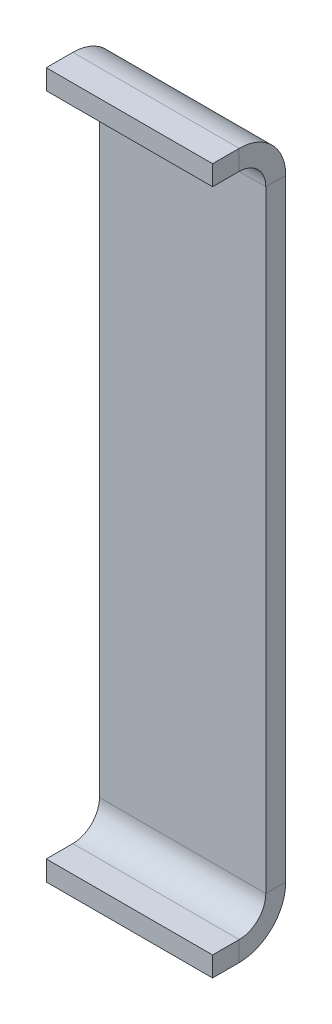
ISO-10303-21;
HEADER;
FILE_DESCRIPTION(('STEP AP214'),'2;1');
FILE_NAME('part.step','',(''),(''),'','','');
FILE_SCHEMA(('AUTOMOTIVE_DESIGN { 1 0 10303 214 1 1 1 1 }'));
ENDSEC;
DATA;
#1=APPLICATION_CONTEXT('core data for automotive mechanical design processes');
#2=APPLICATION_PROTOCOL_DEFINITION('international standard','automotive_design',2000,#1);
#3=PRODUCT_CONTEXT('',#1,'mechanical');
#4=PRODUCT('Part','Part','',(#3));
#5=PRODUCT_RELATED_PRODUCT_CATEGORY('part','',(#4));
#6=PRODUCT_DEFINITION_FORMATION('','',#4);
#7=PRODUCT_DEFINITION_CONTEXT('part definition',#1,'design');
#8=PRODUCT_DEFINITION('design','',#6,#7);
#9=PRODUCT_DEFINITION_SHAPE('','',#8);
#10=(LENGTH_UNIT() NAMED_UNIT(*) SI_UNIT(.MILLI.,.METRE.));
#11=(NAMED_UNIT(*) PLANE_ANGLE_UNIT() SI_UNIT($,.RADIAN.));
#12=(NAMED_UNIT(*) SI_UNIT($,.STERADIAN.) SOLID_ANGLE_UNIT());
#13=UNCERTAINTY_MEASURE_WITH_UNIT(LENGTH_MEASURE(1.E-05),#10,'distance_accuracy_value','');
#14=(GEOMETRIC_REPRESENTATION_CONTEXT(3) GLOBAL_UNCERTAINTY_ASSIGNED_CONTEXT((#13)) GLOBAL_UNIT_ASSIGNED_CONTEXT((#10,
#11,#12)) REPRESENTATION_CONTEXT('',''));
#15=CARTESIAN_POINT('',(0.,0.,0.));
#16=DIRECTION('',(0.,0.,1.));
#17=DIRECTION('',(1.,0.,0.));
#18=AXIS2_PLACEMENT_3D('',#15,#16,#17);
#19=CARTESIAN_POINT('',(-253.5,100.,-7.99999999999993));
#20=DIRECTION('',(1.,0.,0.));
#21=DIRECTION('',(0.,0.,-1.));
#22=AXIS2_PLACEMENT_3D('',#19,#20,#21);
#23=PLANE('',#22);
#24=DIRECTION('',(0.,1.,0.));
#25=VECTOR('',#24,1.);
#26=CARTESIAN_POINT('',(-253.5,100.,-7.99999999999993));
#27=LINE('',#26,#25);
#28=CARTESIAN_POINT('',(-253.5,100.,-7.99999999999993));
#29=VERTEX_POINT('',#28);
#30=CARTESIAN_POINT('',(-253.5,103.,-7.99999999999993));
#31=VERTEX_POINT('',#30);
#32=EDGE_CURVE('E11',#29,#31,#27,.T.);
#33=ORIENTED_EDGE('',*,*,#32,.F.);
#34=CARTESIAN_POINT('',(-253.5,96.,-7.99999999999993));
#35=DIRECTION('',(1.,0.,0.));
#36=DIRECTION('',(0.,0.,-1.));
#37=AXIS2_PLACEMENT_3D('',#34,#35,#36);
#38=CIRCLE('',#37,4.);
#39=CARTESIAN_POINT('',(-253.5,96.,-11.9999999999999));
#40=VERTEX_POINT('',#39);
#41=EDGE_CURVE('E242',#40,#29,#38,.T.);
#42=ORIENTED_EDGE('',*,*,#41,.F.);
#43=DIRECTION('',(0.,0.,1.));
#44=VECTOR('',#43,1.);
#45=CARTESIAN_POINT('',(-253.5,96.,-14.9999999999999));
#46=LINE('',#45,#44);
#47=CARTESIAN_POINT('',(-253.5,96.,-14.9999999999999));
#48=VERTEX_POINT('',#47);
#49=EDGE_CURVE('E45',#48,#40,#46,.T.);
#50=ORIENTED_EDGE('',*,*,#49,.F.);
#51=CARTESIAN_POINT('',(-253.5,96.,-7.99999999999993));
#52=DIRECTION('',(1.,0.,0.));
#53=DIRECTION('',(0.,0.,-1.));
#54=AXIS2_PLACEMENT_3D('',#51,#52,#53);
#55=CIRCLE('',#54,7.);
#56=EDGE_CURVE('E169',#48,#31,#55,.T.);
#57=ORIENTED_EDGE('',*,*,#56,.T.);
#58=EDGE_LOOP('',(#33,#42,#50,#57));
#59=FACE_BOUND('',#58,.T.);
#60=ADVANCED_FACE('F37',(#59),#23,.T.);
#61=CARTESIAN_POINT('',(-253.5,96.,-14.9999999999999));
#62=DIRECTION('',(1.,0.,0.));
#63=DIRECTION('',(0.,0.,-1.));
#64=AXIS2_PLACEMENT_3D('',#61,#62,#63);
#65=PLANE('',#64);
#66=DIRECTION('',(0.,0.,1.));
#67=VECTOR('',#66,1.);
#68=CARTESIAN_POINT('',(-253.5,100.,-11.9999999999999));
#69=LINE('',#68,#67);
#70=CARTESIAN_POINT('',(-253.5,100.,-3.99999999999993));
#71=VERTEX_POINT('',#70);
#72=EDGE_CURVE('E246',#29,#71,#69,.T.);
#73=ORIENTED_EDGE('',*,*,#72,.F.);
#74=ORIENTED_EDGE('',*,*,#32,.T.);
#75=DIRECTION('',(0.,0.,-1.));
#76=VECTOR('',#75,1.);
#77=CARTESIAN_POINT('',(-253.5,103.,-11.9999999999999));
#78=LINE('',#77,#76);
#79=CARTESIAN_POINT('',(-253.5,103.,-3.99999999999993));
#80=VERTEX_POINT('',#79);
#81=EDGE_CURVE('E105',#31,#80,#78,.F.);
#82=ORIENTED_EDGE('',*,*,#81,.T.);
#83=DIRECTION('',(0.,1.,0.));
#84=VECTOR('',#83,1.);
#85=CARTESIAN_POINT('',(-253.5,100.,-3.99999999999993));
#86=LINE('',#85,#84);
#87=EDGE_CURVE('E517',#71,#80,#86,.T.);
#88=ORIENTED_EDGE('',*,*,#87,.F.);
#89=EDGE_LOOP('',(#73,#74,#82,#88));
#90=FACE_BOUND('',#89,.T.);
#91=ADVANCED_FACE('F295',(#90),#65,.T.);
#92=CARTESIAN_POINT('',(-278.5,96.,-11.9999999999999));
#93=DIRECTION('',(-1.,0.,0.));
#94=DIRECTION('',(0.,0.,1.));
#95=AXIS2_PLACEMENT_3D('',#92,#93,#94);
#96=PLANE('',#95);
#97=DIRECTION('',(0.,0.,-1.));
#98=VECTOR('',#97,1.);
#99=CARTESIAN_POINT('',(-278.5,96.,-11.9999999999999));
#100=LINE('',#99,#98);
#101=CARTESIAN_POINT('',(-278.5,96.,-11.9999999999999));
#102=VERTEX_POINT('',#101);
#103=CARTESIAN_POINT('',(-278.5,96.,-14.9999999999999));
#104=VERTEX_POINT('',#103);
#105=EDGE_CURVE('E92',#102,#104,#100,.T.);
#106=ORIENTED_EDGE('',*,*,#105,.F.);
#107=CARTESIAN_POINT('',(-278.5,96.,-7.99999999999993));
#108=DIRECTION('',(1.,0.,0.));
#109=DIRECTION('',(0.,0.,-1.));
#110=AXIS2_PLACEMENT_3D('',#107,#108,#109);
#111=CIRCLE('',#110,4.);
#112=CARTESIAN_POINT('',(-278.5,100.,-7.99999999999993));
#113=VERTEX_POINT('',#112);
#114=EDGE_CURVE('E184',#102,#113,#111,.T.);
#115=ORIENTED_EDGE('',*,*,#114,.T.);
#116=DIRECTION('',(0.,-1.,0.));
#117=VECTOR('',#116,1.);
#118=CARTESIAN_POINT('',(-278.5,103.,-7.99999999999993));
#119=LINE('',#118,#117);
#120=CARTESIAN_POINT('',(-278.5,103.,-7.99999999999993));
#121=VERTEX_POINT('',#120);
#122=EDGE_CURVE('E99',#121,#113,#119,.T.);
#123=ORIENTED_EDGE('',*,*,#122,.F.);
#124=CARTESIAN_POINT('',(-278.5,96.,-7.99999999999993));
#125=DIRECTION('',(1.,0.,0.));
#126=DIRECTION('',(0.,0.,-1.));
#127=AXIS2_PLACEMENT_3D('',#124,#125,#126);
#128=CIRCLE('',#127,7.);
#129=EDGE_CURVE('E203',#104,#121,#128,.T.);
#130=ORIENTED_EDGE('',*,*,#129,.F.);
#131=EDGE_LOOP('',(#106,#115,#123,#130));
#132=FACE_BOUND('',#131,.T.);
#133=ADVANCED_FACE('F299',(#132),#96,.T.);
#134=CARTESIAN_POINT('',(-278.5,103.,-7.99999999999993));
#135=DIRECTION('',(-1.,0.,0.));
#136=DIRECTION('',(0.,0.,1.));
#137=AXIS2_PLACEMENT_3D('',#134,#135,#136);
#138=PLANE('',#137);
#139=DIRECTION('',(0.,1.,0.));
#140=VECTOR('',#139,1.);
#141=CARTESIAN_POINT('',(-278.5,100.,-11.9999999999999));
#142=LINE('',#141,#140);
#143=CARTESIAN_POINT('',(-278.5,3.99999999999999,-11.9999999999999));
#144=VERTEX_POINT('',#143);
#145=EDGE_CURVE('E186',#144,#102,#142,.T.);
#146=ORIENTED_EDGE('',*,*,#145,.T.);
#147=ORIENTED_EDGE('',*,*,#105,.T.);
#148=DIRECTION('',(0.,1.,0.));
#149=VECTOR('',#148,1.);
#150=CARTESIAN_POINT('',(-278.5,100.,-14.9999999999999));
#151=LINE('',#150,#149);
#152=CARTESIAN_POINT('',(-278.5,3.99999999999999,-14.9999999999999));
#153=VERTEX_POINT('',#152);
#154=EDGE_CURVE('E201',#153,#104,#151,.T.);
#155=ORIENTED_EDGE('',*,*,#154,.F.);
#156=DIRECTION('',(0.,0.,1.));
#157=VECTOR('',#156,1.);
#158=CARTESIAN_POINT('',(-278.5,3.99999999999999,-14.9999999999999));
#159=LINE('',#158,#157);
#160=EDGE_CURVE('E229',#153,#144,#159,.T.);
#161=ORIENTED_EDGE('',*,*,#160,.T.);
#162=EDGE_LOOP('',(#146,#147,#155,#161));
#163=FACE_BOUND('',#162,.T.);
#164=ADVANCED_FACE('F272',(#163),#138,.T.);
#165=CARTESIAN_POINT('',(-253.5,3.99999999999999,-11.9999999999999));
#166=DIRECTION('',(1.,0.,0.));
#167=DIRECTION('',(0.,0.,-1.));
#168=AXIS2_PLACEMENT_3D('',#165,#166,#167);
#169=PLANE('',#168);
#170=DIRECTION('',(0.,0.,-1.));
#171=VECTOR('',#170,1.);
#172=CARTESIAN_POINT('',(-253.5,3.99999999999999,-11.9999999999999));
#173=LINE('',#172,#171);
#174=CARTESIAN_POINT('',(-253.5,3.99999999999999,-11.9999999999999));
#175=VERTEX_POINT('',#174);
#176=CARTESIAN_POINT('',(-253.5,4.,-14.9999999999999));
#177=VERTEX_POINT('',#176);
#178=EDGE_CURVE('E133',#175,#177,#173,.T.);
#179=ORIENTED_EDGE('',*,*,#178,.F.);
#180=CARTESIAN_POINT('',(-253.5,3.99999999999999,-7.99999999999994));
#181=DIRECTION('',(1.,0.,0.));
#182=DIRECTION('',(0.,0.,-1.));
#183=AXIS2_PLACEMENT_3D('',#180,#181,#182);
#184=CIRCLE('',#183,4.);
#185=CARTESIAN_POINT('',(-253.5,0.,-7.99999999999994));
#186=VERTEX_POINT('',#185);
#187=EDGE_CURVE('E249',#186,#175,#184,.T.);
#188=ORIENTED_EDGE('',*,*,#187,.F.);
#189=DIRECTION('',(0.,1.,0.));
#190=VECTOR('',#189,1.);
#191=CARTESIAN_POINT('',(-253.5,-3.00000000000001,-7.99999999999994));
#192=LINE('',#191,#190);
#193=CARTESIAN_POINT('',(-253.5,-3.00000000000001,-7.99999999999994));
#194=VERTEX_POINT('',#193);
#195=EDGE_CURVE('E145',#194,#186,#192,.T.);
#196=ORIENTED_EDGE('',*,*,#195,.F.);
#197=CARTESIAN_POINT('',(-253.5,3.99999999999999,-7.99999999999994));
#198=DIRECTION('',(1.,0.,0.));
#199=DIRECTION('',(0.,0.,-1.));
#200=AXIS2_PLACEMENT_3D('',#197,#198,#199);
#201=CIRCLE('',#200,7.);
#202=EDGE_CURVE('E148',#194,#177,#201,.T.);
#203=ORIENTED_EDGE('',*,*,#202,.T.);
#204=EDGE_LOOP('',(#179,#188,#196,#203));
#205=FACE_BOUND('',#204,.T.);
#206=ADVANCED_FACE('F150',(#205),#169,.T.);
#207=CARTESIAN_POINT('',(-253.5,-3.00000000000001,-7.99999999999994));
#208=DIRECTION('',(1.,0.,0.));
#209=DIRECTION('',(0.,0.,-1.));
#210=AXIS2_PLACEMENT_3D('',#207,#208,#209);
#211=PLANE('',#210);
#212=DIRECTION('',(0.,1.,0.));
#213=VECTOR('',#212,1.);
#214=CARTESIAN_POINT('',(-253.5,100.,-11.9999999999999));
#215=LINE('',#214,#213);
#216=EDGE_CURVE('E140',#175,#40,#215,.T.);
#217=ORIENTED_EDGE('',*,*,#216,.F.);
#218=ORIENTED_EDGE('',*,*,#178,.T.);
#219=DIRECTION('',(0.,1.,0.));
#220=VECTOR('',#219,1.);
#221=CARTESIAN_POINT('',(-253.5,100.,-14.9999999999999));
#222=LINE('',#221,#220);
#223=EDGE_CURVE('E137',#177,#48,#222,.T.);
#224=ORIENTED_EDGE('',*,*,#223,.T.);
#225=ORIENTED_EDGE('',*,*,#49,.T.);
#226=EDGE_LOOP('',(#217,#218,#224,#225));
#227=FACE_BOUND('',#226,.T.);
#228=ADVANCED_FACE('F135',(#227),#211,.T.);
#229=CARTESIAN_POINT('',(-278.5,0.,-7.99999999999994));
#230=DIRECTION('',(-1.,0.,0.));
#231=DIRECTION('',(0.,0.,1.));
#232=AXIS2_PLACEMENT_3D('',#229,#230,#231);
#233=PLANE('',#232);
#234=DIRECTION('',(0.,-1.,0.));
#235=VECTOR('',#234,1.);
#236=CARTESIAN_POINT('',(-278.5,0.,-7.99999999999994));
#237=LINE('',#236,#235);
#238=CARTESIAN_POINT('',(-278.5,0.,-7.99999999999994));
#239=VERTEX_POINT('',#238);
#240=CARTESIAN_POINT('',(-278.5,-3.00000000000001,-7.99999999999994));
#241=VERTEX_POINT('',#240);
#242=EDGE_CURVE('E231',#239,#241,#237,.T.);
#243=ORIENTED_EDGE('',*,*,#242,.F.);
#244=CARTESIAN_POINT('',(-278.5,3.99999999999999,-7.99999999999994));
#245=DIRECTION('',(1.,0.,0.));
#246=DIRECTION('',(0.,0.,-1.));
#247=AXIS2_PLACEMENT_3D('',#244,#245,#246);
#248=CIRCLE('',#247,4.);
#249=EDGE_CURVE('E188',#239,#144,#248,.T.);
#250=ORIENTED_EDGE('',*,*,#249,.T.);
#251=ORIENTED_EDGE('',*,*,#160,.F.);
#252=CARTESIAN_POINT('',(-278.5,3.99999999999999,-7.99999999999994));
#253=DIRECTION('',(1.,0.,0.));
#254=DIRECTION('',(0.,0.,-1.));
#255=AXIS2_PLACEMENT_3D('',#252,#253,#254);
#256=CIRCLE('',#255,7.);
#257=EDGE_CURVE('E161',#241,#153,#256,.T.);
#258=ORIENTED_EDGE('',*,*,#257,.F.);
#259=EDGE_LOOP('',(#243,#250,#251,#258));
#260=FACE_BOUND('',#259,.T.);
#261=ADVANCED_FACE('F270',(#260),#233,.T.);
#262=CARTESIAN_POINT('',(-278.5,3.99999999999999,-14.9999999999999));
#263=DIRECTION('',(-1.,0.,0.));
#264=DIRECTION('',(0.,0.,1.));
#265=AXIS2_PLACEMENT_3D('',#262,#263,#264);
#266=PLANE('',#265);
#267=DIRECTION('',(0.,0.,-1.));
#268=VECTOR('',#267,1.);
#269=CARTESIAN_POINT('',(-278.5,0.,-11.9999999999999));
#270=LINE('',#269,#268);
#271=CARTESIAN_POINT('',(-278.5,0.,-3.99999999999996));
#272=VERTEX_POINT('',#271);
#273=EDGE_CURVE('E191',#272,#239,#270,.T.);
#274=ORIENTED_EDGE('',*,*,#273,.T.);
#275=ORIENTED_EDGE('',*,*,#242,.T.);
#276=DIRECTION('',(0.,0.,-1.));
#277=VECTOR('',#276,1.);
#278=CARTESIAN_POINT('',(-278.5,-3.00000000000001,-11.9999999999999));
#279=LINE('',#278,#277);
#280=CARTESIAN_POINT('',(-278.5,-3.00000000000001,-3.99999999999996));
#281=VERTEX_POINT('',#280);
#282=EDGE_CURVE('E197',#281,#241,#279,.T.);
#283=ORIENTED_EDGE('',*,*,#282,.F.);
#284=DIRECTION('',(0.,1.,0.));
#285=VECTOR('',#284,1.);
#286=CARTESIAN_POINT('',(-278.5,-3.00000000000001,-3.99999999999996));
#287=LINE('',#286,#285);
#288=EDGE_CURVE('E194',#281,#272,#287,.T.);
#289=ORIENTED_EDGE('',*,*,#288,.T.);
#290=EDGE_LOOP('',(#274,#275,#283,#289));
#291=FACE_BOUND('',#290,.T.);
#292=ADVANCED_FACE('F282',(#291),#266,.T.);
#293=CARTESIAN_POINT('',(-253.5,103.,-11.9999999999999));
#294=DIRECTION('',(0.,-1.,0.));
#295=DIRECTION('',(1.,0.,0.));
#296=AXIS2_PLACEMENT_3D('',#293,#294,#295);
#297=PLANE('',#296);
#298=DIRECTION('',(0.,0.,-1.));
#299=VECTOR('',#298,1.);
#300=CARTESIAN_POINT('',(-278.5,103.,-11.9999999999999));
#301=LINE('',#300,#299);
#302=CARTESIAN_POINT('',(-278.5,103.,-3.99999999999993));
#303=VERTEX_POINT('',#302);
#304=EDGE_CURVE('E175',#121,#303,#301,.F.);
#305=ORIENTED_EDGE('',*,*,#304,.T.);
#306=DIRECTION('',(-1.,0.,0.));
#307=VECTOR('',#306,1.);
#308=CARTESIAN_POINT('',(-253.5,103.,-3.99999999999993));
#309=LINE('',#308,#307);
#310=EDGE_CURVE('E227',#80,#303,#309,.T.);
#311=ORIENTED_EDGE('',*,*,#310,.F.);
#312=ORIENTED_EDGE('',*,*,#81,.F.);
#313=DIRECTION('',(-1.,0.,0.));
#314=VECTOR('',#313,1.);
#315=CARTESIAN_POINT('',(-253.5,103.,-7.99999999999993));
#316=LINE('',#315,#314);
#317=EDGE_CURVE('E171',#31,#121,#316,.T.);
#318=ORIENTED_EDGE('',*,*,#317,.T.);
#319=EDGE_LOOP('',(#305,#311,#312,#318));
#320=FACE_BOUND('',#319,.T.);
#321=ADVANCED_FACE('F284',(#320),#297,.F.);
#322=CARTESIAN_POINT('',(-253.5,100.,-3.99999999999993));
#323=DIRECTION('',(0.,0.,1.));
#324=DIRECTION('',(1.,0.,0.));
#325=AXIS2_PLACEMENT_3D('',#322,#323,#324);
#326=PLANE('',#325);
#327=DIRECTION('',(0.,1.,0.));
#328=VECTOR('',#327,1.);
#329=CARTESIAN_POINT('',(-278.5,100.,-3.99999999999993));
#330=LINE('',#329,#328);
#331=CARTESIAN_POINT('',(-278.5,100.,-3.99999999999993));
#332=VERTEX_POINT('',#331);
#333=EDGE_CURVE('E178',#332,#303,#330,.T.);
#334=ORIENTED_EDGE('',*,*,#333,.F.);
#335=DIRECTION('',(-1.,0.,0.));
#336=VECTOR('',#335,1.);
#337=CARTESIAN_POINT('',(-253.5,100.,-3.99999999999993));
#338=LINE('',#337,#336);
#339=EDGE_CURVE('E225',#71,#332,#338,.T.);
#340=ORIENTED_EDGE('',*,*,#339,.F.);
#341=ORIENTED_EDGE('',*,*,#87,.T.);
#342=ORIENTED_EDGE('',*,*,#310,.T.);
#343=EDGE_LOOP('',(#334,#340,#341,#342));
#344=FACE_BOUND('',#343,.T.);
#345=ADVANCED_FACE('F290',(#344),#326,.T.);
#346=CARTESIAN_POINT('',(-253.5,100.,-11.9999999999999));
#347=DIRECTION('',(0.,-1.,0.));
#348=DIRECTION('',(1.,0.,0.));
#349=AXIS2_PLACEMENT_3D('',#346,#347,#348);
#350=PLANE('',#349);
#351=DIRECTION('',(0.,0.,1.));
#352=VECTOR('',#351,1.);
#353=CARTESIAN_POINT('',(-278.5,100.,-11.9999999999999));
#354=LINE('',#353,#352);
#355=EDGE_CURVE('E181',#113,#332,#354,.T.);
#356=ORIENTED_EDGE('',*,*,#355,.F.);
#357=DIRECTION('',(-1.,0.,0.));
#358=VECTOR('',#357,1.);
#359=CARTESIAN_POINT('',(-253.5,100.,-7.99999999999993));
#360=LINE('',#359,#358);
#361=EDGE_CURVE('E222',#29,#113,#360,.T.);
#362=ORIENTED_EDGE('',*,*,#361,.F.);
#363=ORIENTED_EDGE('',*,*,#72,.T.);
#364=ORIENTED_EDGE('',*,*,#339,.T.);
#365=EDGE_LOOP('',(#356,#362,#363,#364));
#366=FACE_BOUND('',#365,.T.);
#367=ADVANCED_FACE('F343',(#366),#350,.T.);
#368=CARTESIAN_POINT('',(-253.5,96.,-7.99999999999993));
#369=DIRECTION('',(-1.,0.,0.));
#370=DIRECTION('',(0.,-1.,0.));
#371=AXIS2_PLACEMENT_3D('',#368,#369,#370);
#372=CYLINDRICAL_SURFACE('',#371,4.);
#373=ORIENTED_EDGE('',*,*,#114,.F.);
#374=DIRECTION('',(-1.,0.,0.));
#375=VECTOR('',#374,1.);
#376=CARTESIAN_POINT('',(-253.5,96.,-11.9999999999999));
#377=LINE('',#376,#375);
#378=EDGE_CURVE('E219',#40,#102,#377,.T.);
#379=ORIENTED_EDGE('',*,*,#378,.F.);
#380=ORIENTED_EDGE('',*,*,#41,.T.);
#381=ORIENTED_EDGE('',*,*,#361,.T.);
#382=EDGE_LOOP('',(#373,#379,#380,#381));
#383=FACE_BOUND('',#382,.T.);
#384=ADVANCED_FACE('F241',(#383),#372,.F.);
#385=CARTESIAN_POINT('',(-253.5,100.,-11.9999999999999));
#386=DIRECTION('',(0.,0.,1.));
#387=DIRECTION('',(0.,-1.,0.));
#388=AXIS2_PLACEMENT_3D('',#385,#386,#387);
#389=PLANE('',#388);
#390=ORIENTED_EDGE('',*,*,#145,.F.);
#391=DIRECTION('',(-1.,0.,0.));
#392=VECTOR('',#391,1.);
#393=CARTESIAN_POINT('',(-253.5,3.99999999999999,-11.9999999999999));
#394=LINE('',#393,#392);
#395=EDGE_CURVE('E216',#175,#144,#394,.T.);
#396=ORIENTED_EDGE('',*,*,#395,.F.);
#397=ORIENTED_EDGE('',*,*,#216,.T.);
#398=ORIENTED_EDGE('',*,*,#378,.T.);
#399=EDGE_LOOP('',(#390,#396,#397,#398));
#400=FACE_BOUND('',#399,.T.);
#401=ADVANCED_FACE('F248',(#400),#389,.T.);
#402=CARTESIAN_POINT('',(-253.5,3.99999999999999,-7.99999999999994));
#403=DIRECTION('',(-1.,0.,0.));
#404=DIRECTION('',(0.,-1.,0.));
#405=AXIS2_PLACEMENT_3D('',#402,#403,#404);
#406=CYLINDRICAL_SURFACE('',#405,4.);
#407=ORIENTED_EDGE('',*,*,#249,.F.);
#408=DIRECTION('',(-1.,0.,0.));
#409=VECTOR('',#408,1.);
#410=CARTESIAN_POINT('',(-253.5,0.,-7.99999999999994));
#411=LINE('',#410,#409);
#412=EDGE_CURVE('E213',#186,#239,#411,.T.);
#413=ORIENTED_EDGE('',*,*,#412,.F.);
#414=ORIENTED_EDGE('',*,*,#187,.T.);
#415=ORIENTED_EDGE('',*,*,#395,.T.);
#416=EDGE_LOOP('',(#407,#413,#414,#415));
#417=FACE_BOUND('',#416,.T.);
#418=ADVANCED_FACE('F274',(#417),#406,.F.);
#419=CARTESIAN_POINT('',(-253.5,0.,-11.9999999999999));
#420=DIRECTION('',(0.,1.,0.));
#421=DIRECTION('',(-1.,0.,0.));
#422=AXIS2_PLACEMENT_3D('',#419,#420,#421);
#423=PLANE('',#422);
#424=ORIENTED_EDGE('',*,*,#273,.F.);
#425=DIRECTION('',(-1.,0.,0.));
#426=VECTOR('',#425,1.);
#427=CARTESIAN_POINT('',(-253.5,0.,-3.99999999999996));
#428=LINE('',#427,#426);
#429=CARTESIAN_POINT('',(-253.5,0.,-3.99999999999996));
#430=VERTEX_POINT('',#429);
#431=EDGE_CURVE('E211',#430,#272,#428,.T.);
#432=ORIENTED_EDGE('',*,*,#431,.F.);
#433=DIRECTION('',(0.,0.,-1.));
#434=VECTOR('',#433,1.);
#435=CARTESIAN_POINT('',(-253.5,0.,-11.9999999999999));
#436=LINE('',#435,#434);
#437=EDGE_CURVE('E251',#430,#186,#436,.T.);
#438=ORIENTED_EDGE('',*,*,#437,.T.);
#439=ORIENTED_EDGE('',*,*,#412,.T.);
#440=EDGE_LOOP('',(#424,#432,#438,#439));
#441=FACE_BOUND('',#440,.T.);
#442=ADVANCED_FACE('F277',(#441),#423,.T.);
#443=CARTESIAN_POINT('',(-253.5,-3.00000000000001,-3.99999999999996));
#444=DIRECTION('',(0.,0.,1.));
#445=DIRECTION('',(1.,0.,0.));
#446=AXIS2_PLACEMENT_3D('',#443,#444,#445);
#447=PLANE('',#446);
#448=ORIENTED_EDGE('',*,*,#288,.F.);
#449=DIRECTION('',(-1.,0.,0.));
#450=VECTOR('',#449,1.);
#451=CARTESIAN_POINT('',(-253.5,-3.00000000000001,-3.99999999999996));
#452=LINE('',#451,#450);
#453=CARTESIAN_POINT('',(-253.5,-3.00000000000001,-3.99999999999996));
#454=VERTEX_POINT('',#453);
#455=EDGE_CURVE('E209',#454,#281,#452,.T.);
#456=ORIENTED_EDGE('',*,*,#455,.F.);
#457=DIRECTION('',(0.,1.,0.));
#458=VECTOR('',#457,1.);
#459=CARTESIAN_POINT('',(-253.5,-3.00000000000001,-3.99999999999996));
#460=LINE('',#459,#458);
#461=EDGE_CURVE('E257',#454,#430,#460,.T.);
#462=ORIENTED_EDGE('',*,*,#461,.T.);
#463=ORIENTED_EDGE('',*,*,#431,.T.);
#464=EDGE_LOOP('',(#448,#456,#462,#463));
#465=FACE_BOUND('',#464,.T.);
#466=ADVANCED_FACE('F280',(#465),#447,.T.);
#467=CARTESIAN_POINT('',(-253.5,-3.00000000000001,-11.9999999999999));
#468=DIRECTION('',(0.,1.,0.));
#469=DIRECTION('',(-1.,0.,0.));
#470=AXIS2_PLACEMENT_3D('',#467,#468,#469);
#471=PLANE('',#470);
#472=ORIENTED_EDGE('',*,*,#282,.T.);
#473=DIRECTION('',(-1.,0.,0.));
#474=VECTOR('',#473,1.);
#475=CARTESIAN_POINT('',(-253.5,-3.00000000000001,-7.99999999999994));
#476=LINE('',#475,#474);
#477=EDGE_CURVE('E163',#194,#241,#476,.T.);
#478=ORIENTED_EDGE('',*,*,#477,.F.);
#479=DIRECTION('',(0.,0.,-1.));
#480=VECTOR('',#479,1.);
#481=CARTESIAN_POINT('',(-253.5,-3.00000000000001,-11.9999999999999));
#482=LINE('',#481,#480);
#483=EDGE_CURVE('E154',#454,#194,#482,.T.);
#484=ORIENTED_EDGE('',*,*,#483,.F.);
#485=ORIENTED_EDGE('',*,*,#455,.T.);
#486=EDGE_LOOP('',(#472,#478,#484,#485));
#487=FACE_BOUND('',#486,.T.);
#488=ADVANCED_FACE('F267',(#487),#471,.F.);
#489=CARTESIAN_POINT('',(-253.5,3.99999999999999,-7.99999999999994));
#490=DIRECTION('',(-1.,0.,0.));
#491=DIRECTION('',(0.,-1.,0.));
#492=AXIS2_PLACEMENT_3D('',#489,#490,#491);
#493=CYLINDRICAL_SURFACE('',#492,7.);
#494=ORIENTED_EDGE('',*,*,#257,.T.);
#495=DIRECTION('',(-1.,0.,0.));
#496=VECTOR('',#495,1.);
#497=CARTESIAN_POINT('',(-253.5,4.,-14.9999999999999));
#498=LINE('',#497,#496);
#499=EDGE_CURVE('E158',#177,#153,#498,.T.);
#500=ORIENTED_EDGE('',*,*,#499,.F.);
#501=ORIENTED_EDGE('',*,*,#202,.F.);
#502=ORIENTED_EDGE('',*,*,#477,.T.);
#503=EDGE_LOOP('',(#494,#500,#501,#502));
#504=FACE_BOUND('',#503,.T.);
#505=ADVANCED_FACE('F159',(#504),#493,.T.);
#506=CARTESIAN_POINT('',(-253.5,100.,-14.9999999999999));
#507=DIRECTION('',(0.,0.,1.));
#508=DIRECTION('',(0.,-1.,0.));
#509=AXIS2_PLACEMENT_3D('',#506,#507,#508);
#510=PLANE('',#509);
#511=ORIENTED_EDGE('',*,*,#154,.T.);
#512=DIRECTION('',(-1.,0.,0.));
#513=VECTOR('',#512,1.);
#514=CARTESIAN_POINT('',(-253.5,96.,-14.9999999999999));
#515=LINE('',#514,#513);
#516=EDGE_CURVE('E164',#48,#104,#515,.T.);
#517=ORIENTED_EDGE('',*,*,#516,.F.);
#518=ORIENTED_EDGE('',*,*,#223,.F.);
#519=ORIENTED_EDGE('',*,*,#499,.T.);
#520=EDGE_LOOP('',(#511,#517,#518,#519));
#521=FACE_BOUND('',#520,.T.);
#522=ADVANCED_FACE('F166',(#521),#510,.F.);
#523=CARTESIAN_POINT('',(-253.5,96.,-7.99999999999993));
#524=DIRECTION('',(-1.,0.,0.));
#525=DIRECTION('',(0.,-1.,0.));
#526=AXIS2_PLACEMENT_3D('',#523,#524,#525);
#527=CYLINDRICAL_SURFACE('',#526,7.);
#528=ORIENTED_EDGE('',*,*,#129,.T.);
#529=ORIENTED_EDGE('',*,*,#317,.F.);
#530=ORIENTED_EDGE('',*,*,#56,.F.);
#531=ORIENTED_EDGE('',*,*,#516,.T.);
#532=EDGE_LOOP('',(#528,#529,#530,#531));
#533=FACE_BOUND('',#532,.T.);
#534=ADVANCED_FACE('F427',(#533),#527,.T.);
#535=CARTESIAN_POINT('',(-253.5,96.,-7.99999999999993));
#536=DIRECTION('',(1.,0.,0.));
#537=DIRECTION('',(0.,-1.,0.));
#538=AXIS2_PLACEMENT_3D('',#535,#536,#537);
#539=PLANE('',#538);
#540=ORIENTED_EDGE('',*,*,#483,.T.);
#541=ORIENTED_EDGE('',*,*,#195,.T.);
#542=ORIENTED_EDGE('',*,*,#437,.F.);
#543=ORIENTED_EDGE('',*,*,#461,.F.);
#544=EDGE_LOOP('',(#540,#541,#542,#543));
#545=FACE_BOUND('',#544,.T.);
#546=ADVANCED_FACE('F263',(#545),#539,.T.);
#547=CARTESIAN_POINT('',(-278.5,96.,-7.99999999999993));
#548=DIRECTION('',(1.,0.,0.));
#549=DIRECTION('',(0.,-1.,0.));
#550=AXIS2_PLACEMENT_3D('',#547,#548,#549);
#551=PLANE('',#550);
#552=ORIENTED_EDGE('',*,*,#304,.F.);
#553=ORIENTED_EDGE('',*,*,#122,.T.);
#554=ORIENTED_EDGE('',*,*,#355,.T.);
#555=ORIENTED_EDGE('',*,*,#333,.T.);
#556=EDGE_LOOP('',(#552,#553,#554,#555));
#557=FACE_BOUND('',#556,.T.);
#558=ADVANCED_FACE('F447',(#557),#551,.F.);
#559=CLOSED_SHELL('',(#60,#91,#133,#164,#206,#228,#261,#292,#321,#345,#367,#384,#401,#418,#442,
#466,#488,#505,#522,#534,#546,#558));
#560=MANIFOLD_SOLID_BREP('B2',#559);
#561=ADVANCED_BREP_SHAPE_REPRESENTATION('',(#18,#560),#14);
#562=SHAPE_DEFINITION_REPRESENTATION(#9,#561);
ENDSEC;
END-ISO-10303-21;
